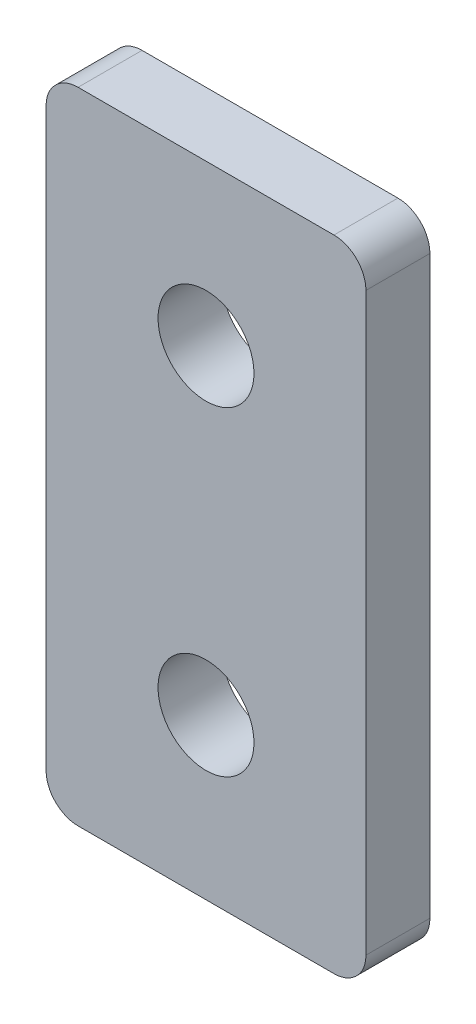
ISO-10303-21;
HEADER;
FILE_DESCRIPTION(('STEP AP214'),'2;1');
FILE_NAME('part.step','',(''),(''),'','','');
FILE_SCHEMA(('AUTOMOTIVE_DESIGN { 1 0 10303 214 1 1 1 1 }'));
ENDSEC;
DATA;
#1=APPLICATION_CONTEXT('core data for automotive mechanical design processes');
#2=APPLICATION_PROTOCOL_DEFINITION('international standard','automotive_design',2000,#1);
#3=PRODUCT_CONTEXT('',#1,'mechanical');
#4=PRODUCT('Part','Part','',(#3));
#5=PRODUCT_RELATED_PRODUCT_CATEGORY('part','',(#4));
#6=PRODUCT_DEFINITION_FORMATION('','',#4);
#7=PRODUCT_DEFINITION_CONTEXT('part definition',#1,'design');
#8=PRODUCT_DEFINITION('design','',#6,#7);
#9=PRODUCT_DEFINITION_SHAPE('','',#8);
#10=(LENGTH_UNIT() NAMED_UNIT(*) SI_UNIT(.MILLI.,.METRE.));
#11=(NAMED_UNIT(*) PLANE_ANGLE_UNIT() SI_UNIT($,.RADIAN.));
#12=(NAMED_UNIT(*) SI_UNIT($,.STERADIAN.) SOLID_ANGLE_UNIT());
#13=UNCERTAINTY_MEASURE_WITH_UNIT(LENGTH_MEASURE(1.E-05),#10,'distance_accuracy_value','');
#14=(GEOMETRIC_REPRESENTATION_CONTEXT(3) GLOBAL_UNCERTAINTY_ASSIGNED_CONTEXT((#13)) GLOBAL_UNIT_ASSIGNED_CONTEXT((#10,
#11,#12)) REPRESENTATION_CONTEXT('',''));
#15=CARTESIAN_POINT('',(0.,0.,0.));
#16=DIRECTION('',(0.,0.,1.));
#17=DIRECTION('',(1.,0.,0.));
#18=AXIS2_PLACEMENT_3D('',#15,#16,#17);
#19=CARTESIAN_POINT('',(0.,0.,2.));
#20=DIRECTION('',(0.,0.,1.));
#21=DIRECTION('',(1.,0.,0.));
#22=AXIS2_PLACEMENT_3D('',#19,#20,#21);
#23=PLANE('',#22);
#24=CARTESIAN_POINT('',(1.64208363104601,-6.90903272023804,2.));
#25=DIRECTION('',(0.,0.,1.));
#26=DIRECTION('',(1.,0.,0.));
#27=AXIS2_PLACEMENT_3D('',#24,#25,#26);
#28=CIRCLE('',#27,1.5);
#29=CARTESIAN_POINT('',(3.14208363104601,-6.90903272023804,2.));
#30=VERTEX_POINT('',#29);
#31=EDGE_CURVE('E136',#30,#30,#28,.T.);
#32=ORIENTED_EDGE('',*,*,#31,.F.);
#33=EDGE_LOOP('',(#32));
#34=FACE_BOUND('',#33,.T.);
#35=DIRECTION('',(0.,-1.,0.));
#36=VECTOR('',#35,1.);
#37=CARTESIAN_POINT('',(-3.35791636895399,-1.90903272023804,2.));
#38=LINE('',#37,#36);
#39=CARTESIAN_POINT('',(-3.35791636895399,-2.90903272023804,2.));
#40=VERTEX_POINT('',#39);
#41=CARTESIAN_POINT('',(-3.35791636895399,-20.909032720238,2.));
#42=VERTEX_POINT('',#41);
#43=EDGE_CURVE('E141',#40,#42,#38,.T.);
#44=ORIENTED_EDGE('',*,*,#43,.T.);
#45=CARTESIAN_POINT('',(-2.35791636895399,-20.909032720238,2.));
#46=DIRECTION('',(0.,0.,1.));
#47=DIRECTION('',(1.,0.,0.));
#48=AXIS2_PLACEMENT_3D('',#45,#46,#47);
#49=CIRCLE('',#48,1.);
#50=CARTESIAN_POINT('',(-2.35791636895399,-21.909032720238,2.));
#51=VERTEX_POINT('',#50);
#52=EDGE_CURVE('E156',#42,#51,#49,.T.);
#53=ORIENTED_EDGE('',*,*,#52,.T.);
#54=DIRECTION('',(1.,0.,0.));
#55=VECTOR('',#54,1.);
#56=CARTESIAN_POINT('',(-3.35791636895399,-21.909032720238,2.));
#57=LINE('',#56,#55);
#58=CARTESIAN_POINT('',(5.64208363104601,-21.909032720238,2.));
#59=VERTEX_POINT('',#58);
#60=EDGE_CURVE('E123',#51,#59,#57,.T.);
#61=ORIENTED_EDGE('',*,*,#60,.T.);
#62=CARTESIAN_POINT('',(5.64208363104601,-20.909032720238,2.));
#63=DIRECTION('',(0.,0.,1.));
#64=DIRECTION('',(1.,0.,0.));
#65=AXIS2_PLACEMENT_3D('',#62,#63,#64);
#66=CIRCLE('',#65,1.);
#67=CARTESIAN_POINT('',(6.64208363104601,-20.909032720238,2.));
#68=VERTEX_POINT('',#67);
#69=EDGE_CURVE('E154',#59,#68,#66,.T.);
#70=ORIENTED_EDGE('',*,*,#69,.T.);
#71=DIRECTION('',(0.,1.,0.));
#72=VECTOR('',#71,1.);
#73=CARTESIAN_POINT('',(6.64208363104601,-1.90903272023804,2.));
#74=LINE('',#73,#72);
#75=CARTESIAN_POINT('',(6.64208363104601,-2.90903272023804,2.));
#76=VERTEX_POINT('',#75);
#77=EDGE_CURVE('E176',#68,#76,#74,.T.);
#78=ORIENTED_EDGE('',*,*,#77,.T.);
#79=CARTESIAN_POINT('',(5.64208363104601,-2.90903272023804,2.));
#80=DIRECTION('',(0.,0.,1.));
#81=DIRECTION('',(1.,0.,0.));
#82=AXIS2_PLACEMENT_3D('',#79,#80,#81);
#83=CIRCLE('',#82,1.);
#84=CARTESIAN_POINT('',(5.64208363104601,-1.90903272023804,2.));
#85=VERTEX_POINT('',#84);
#86=EDGE_CURVE('E58',#76,#85,#83,.T.);
#87=ORIENTED_EDGE('',*,*,#86,.T.);
#88=DIRECTION('',(-1.,0.,0.));
#89=VECTOR('',#88,1.);
#90=CARTESIAN_POINT('',(-3.35791636895399,-1.90903272023804,2.));
#91=LINE('',#90,#89);
#92=CARTESIAN_POINT('',(-2.35791636895399,-1.90903272023804,2.));
#93=VERTEX_POINT('',#92);
#94=EDGE_CURVE('E142',#85,#93,#91,.T.);
#95=ORIENTED_EDGE('',*,*,#94,.T.);
#96=CARTESIAN_POINT('',(-2.35791636895399,-2.90903272023804,2.));
#97=DIRECTION('',(0.,0.,1.));
#98=DIRECTION('',(1.,0.,0.));
#99=AXIS2_PLACEMENT_3D('',#96,#97,#98);
#100=CIRCLE('',#99,1.);
#101=EDGE_CURVE('E152',#93,#40,#100,.T.);
#102=ORIENTED_EDGE('',*,*,#101,.T.);
#103=EDGE_LOOP('',(#44,#53,#61,#70,#78,#87,#95,#102));
#104=FACE_BOUND('',#103,.T.);
#105=CARTESIAN_POINT('',(1.64208363104601,-16.909032720238,2.));
#106=DIRECTION('',(0.,0.,1.));
#107=DIRECTION('',(1.,0.,0.));
#108=AXIS2_PLACEMENT_3D('',#105,#106,#107);
#109=CIRCLE('',#108,1.5);
#110=CARTESIAN_POINT('',(3.14208363104601,-16.909032720238,2.));
#111=VERTEX_POINT('',#110);
#112=EDGE_CURVE('E188',#111,#111,#109,.T.);
#113=ORIENTED_EDGE('',*,*,#112,.F.);
#114=EDGE_LOOP('',(#113));
#115=FACE_BOUND('',#114,.T.);
#116=ADVANCED_FACE('F38',(#34,#104,#115),#23,.T.);
#117=CARTESIAN_POINT('',(0.,0.,0.));
#118=DIRECTION('',(0.,0.,1.));
#119=DIRECTION('',(1.,0.,0.));
#120=AXIS2_PLACEMENT_3D('',#117,#118,#119);
#121=PLANE('',#120);
#122=DIRECTION('',(1.,0.,0.));
#123=VECTOR('',#122,1.);
#124=CARTESIAN_POINT('',(-3.35791636895399,-21.909032720238,0.));
#125=LINE('',#124,#123);
#126=CARTESIAN_POINT('',(-2.35791636895399,-21.909032720238,0.));
#127=VERTEX_POINT('',#126);
#128=CARTESIAN_POINT('',(5.64208363104601,-21.909032720238,0.));
#129=VERTEX_POINT('',#128);
#130=EDGE_CURVE('E120',#127,#129,#125,.T.);
#131=ORIENTED_EDGE('',*,*,#130,.F.);
#132=CARTESIAN_POINT('',(-2.35791636895399,-20.909032720238,0.));
#133=DIRECTION('',(0.,0.,1.));
#134=DIRECTION('',(1.,0.,0.));
#135=AXIS2_PLACEMENT_3D('',#132,#133,#134);
#136=CIRCLE('',#135,1.);
#137=CARTESIAN_POINT('',(-3.35791636895399,-20.909032720238,0.));
#138=VERTEX_POINT('',#137);
#139=EDGE_CURVE('E103',#127,#138,#136,.F.);
#140=ORIENTED_EDGE('',*,*,#139,.T.);
#141=DIRECTION('',(0.,-1.,0.));
#142=VECTOR('',#141,1.);
#143=CARTESIAN_POINT('',(-3.35791636895399,-1.90903272023804,0.));
#144=LINE('',#143,#142);
#145=CARTESIAN_POINT('',(-3.35791636895399,-2.90903272023804,0.));
#146=VERTEX_POINT('',#145);
#147=EDGE_CURVE('E131',#146,#138,#144,.T.);
#148=ORIENTED_EDGE('',*,*,#147,.F.);
#149=CARTESIAN_POINT('',(-2.35791636895399,-2.90903272023804,0.));
#150=DIRECTION('',(0.,0.,1.));
#151=DIRECTION('',(1.,0.,0.));
#152=AXIS2_PLACEMENT_3D('',#149,#150,#151);
#153=CIRCLE('',#152,1.);
#154=CARTESIAN_POINT('',(-2.35791636895399,-1.90903272023804,0.));
#155=VERTEX_POINT('',#154);
#156=EDGE_CURVE('E145',#146,#155,#153,.F.);
#157=ORIENTED_EDGE('',*,*,#156,.T.);
#158=DIRECTION('',(-1.,0.,0.));
#159=VECTOR('',#158,1.);
#160=CARTESIAN_POINT('',(-3.35791636895399,-1.90903272023804,0.));
#161=LINE('',#160,#159);
#162=CARTESIAN_POINT('',(5.64208363104601,-1.90903272023804,0.));
#163=VERTEX_POINT('',#162);
#164=EDGE_CURVE('E134',#163,#155,#161,.T.);
#165=ORIENTED_EDGE('',*,*,#164,.F.);
#166=CARTESIAN_POINT('',(5.64208363104601,-2.90903272023804,0.));
#167=DIRECTION('',(0.,0.,1.));
#168=DIRECTION('',(1.,0.,0.));
#169=AXIS2_PLACEMENT_3D('',#166,#167,#168);
#170=CIRCLE('',#169,1.);
#171=CARTESIAN_POINT('',(6.64208363104601,-2.90903272023804,0.));
#172=VERTEX_POINT('',#171);
#173=EDGE_CURVE('E124',#163,#172,#170,.F.);
#174=ORIENTED_EDGE('',*,*,#173,.T.);
#175=DIRECTION('',(0.,1.,0.));
#176=VECTOR('',#175,1.);
#177=CARTESIAN_POINT('',(6.64208363104601,-1.90903272023804,0.));
#178=LINE('',#177,#176);
#179=CARTESIAN_POINT('',(6.64208363104601,-20.909032720238,0.));
#180=VERTEX_POINT('',#179);
#181=EDGE_CURVE('E130',#180,#172,#178,.T.);
#182=ORIENTED_EDGE('',*,*,#181,.F.);
#183=CARTESIAN_POINT('',(5.64208363104601,-20.909032720238,0.));
#184=DIRECTION('',(0.,0.,1.));
#185=DIRECTION('',(1.,0.,0.));
#186=AXIS2_PLACEMENT_3D('',#183,#184,#185);
#187=CIRCLE('',#186,1.);
#188=EDGE_CURVE('E114',#180,#129,#187,.F.);
#189=ORIENTED_EDGE('',*,*,#188,.T.);
#190=EDGE_LOOP('',(#131,#140,#148,#157,#165,#174,#182,#189));
#191=FACE_BOUND('',#190,.T.);
#192=CARTESIAN_POINT('',(1.64208363104601,-6.90903272023804,0.));
#193=DIRECTION('',(0.,0.,1.));
#194=DIRECTION('',(1.,0.,0.));
#195=AXIS2_PLACEMENT_3D('',#192,#193,#194);
#196=CIRCLE('',#195,1.5);
#197=CARTESIAN_POINT('',(3.14208363104601,-6.90903272023804,0.));
#198=VERTEX_POINT('',#197);
#199=EDGE_CURVE('E179',#198,#198,#196,.T.);
#200=ORIENTED_EDGE('',*,*,#199,.T.);
#201=EDGE_LOOP('',(#200));
#202=FACE_BOUND('',#201,.T.);
#203=CARTESIAN_POINT('',(1.64208363104601,-16.909032720238,0.));
#204=DIRECTION('',(0.,0.,1.));
#205=DIRECTION('',(1.,0.,0.));
#206=AXIS2_PLACEMENT_3D('',#203,#204,#205);
#207=CIRCLE('',#206,1.5);
#208=CARTESIAN_POINT('',(3.14208363104601,-16.909032720238,0.));
#209=VERTEX_POINT('',#208);
#210=EDGE_CURVE('E190',#209,#209,#207,.T.);
#211=ORIENTED_EDGE('',*,*,#210,.T.);
#212=EDGE_LOOP('',(#211));
#213=FACE_BOUND('',#212,.T.);
#214=ADVANCED_FACE('F127',(#191,#202,#213),#121,.F.);
#215=CARTESIAN_POINT('',(-3.35791636895399,-1.90903272023804,2.));
#216=DIRECTION('',(1.,0.,0.));
#217=DIRECTION('',(0.,1.,0.));
#218=AXIS2_PLACEMENT_3D('',#215,#216,#217);
#219=PLANE('',#218);
#220=ORIENTED_EDGE('',*,*,#147,.T.);
#221=DIRECTION('',(0.,0.,-1.));
#222=VECTOR('',#221,1.);
#223=CARTESIAN_POINT('',(-3.35791636895399,-20.909032720238,2.));
#224=LINE('',#223,#222);
#225=EDGE_CURVE('E108',#138,#42,#224,.F.);
#226=ORIENTED_EDGE('',*,*,#225,.T.);
#227=ORIENTED_EDGE('',*,*,#43,.F.);
#228=DIRECTION('',(0.,0.,-1.));
#229=VECTOR('',#228,1.);
#230=CARTESIAN_POINT('',(-3.35791636895399,-2.90903272023804,2.));
#231=LINE('',#230,#229);
#232=EDGE_CURVE('E113',#40,#146,#231,.T.);
#233=ORIENTED_EDGE('',*,*,#232,.T.);
#234=EDGE_LOOP('',(#220,#226,#227,#233));
#235=FACE_BOUND('',#234,.T.);
#236=ADVANCED_FACE('F173',(#235),#219,.F.);
#237=CARTESIAN_POINT('',(-3.35791636895399,-21.909032720238,2.));
#238=DIRECTION('',(0.,1.,0.));
#239=DIRECTION('',(0.,0.,1.));
#240=AXIS2_PLACEMENT_3D('',#237,#238,#239);
#241=PLANE('',#240);
#242=ORIENTED_EDGE('',*,*,#60,.F.);
#243=DIRECTION('',(0.,0.,-1.));
#244=VECTOR('',#243,1.);
#245=CARTESIAN_POINT('',(-2.35791636895399,-21.909032720238,2.));
#246=LINE('',#245,#244);
#247=EDGE_CURVE('E107',#51,#127,#246,.T.);
#248=ORIENTED_EDGE('',*,*,#247,.T.);
#249=ORIENTED_EDGE('',*,*,#130,.T.);
#250=DIRECTION('',(0.,0.,-1.));
#251=VECTOR('',#250,1.);
#252=CARTESIAN_POINT('',(5.64208363104601,-21.909032720238,2.));
#253=LINE('',#252,#251);
#254=EDGE_CURVE('E125',#129,#59,#253,.F.);
#255=ORIENTED_EDGE('',*,*,#254,.T.);
#256=EDGE_LOOP('',(#242,#248,#249,#255));
#257=FACE_BOUND('',#256,.T.);
#258=ADVANCED_FACE('F119',(#257),#241,.F.);
#259=CARTESIAN_POINT('',(6.64208363104601,-1.90903272023804,2.));
#260=DIRECTION('',(-1.,0.,0.));
#261=DIRECTION('',(0.,-1.,0.));
#262=AXIS2_PLACEMENT_3D('',#259,#260,#261);
#263=PLANE('',#262);
#264=ORIENTED_EDGE('',*,*,#77,.F.);
#265=DIRECTION('',(0.,0.,-1.));
#266=VECTOR('',#265,1.);
#267=CARTESIAN_POINT('',(6.64208363104601,-20.909032720238,2.));
#268=LINE('',#267,#266);
#269=EDGE_CURVE('E160',#68,#180,#268,.T.);
#270=ORIENTED_EDGE('',*,*,#269,.T.);
#271=ORIENTED_EDGE('',*,*,#181,.T.);
#272=DIRECTION('',(0.,0.,-1.));
#273=VECTOR('',#272,1.);
#274=CARTESIAN_POINT('',(6.64208363104601,-2.90903272023804,2.));
#275=LINE('',#274,#273);
#276=EDGE_CURVE('E158',#172,#76,#275,.F.);
#277=ORIENTED_EDGE('',*,*,#276,.T.);
#278=EDGE_LOOP('',(#264,#270,#271,#277));
#279=FACE_BOUND('',#278,.T.);
#280=ADVANCED_FACE('F219',(#279),#263,.F.);
#281=CARTESIAN_POINT('',(-3.35791636895399,-1.90903272023804,2.));
#282=DIRECTION('',(0.,-1.,0.));
#283=DIRECTION('',(0.,0.,-1.));
#284=AXIS2_PLACEMENT_3D('',#281,#282,#283);
#285=PLANE('',#284);
#286=ORIENTED_EDGE('',*,*,#164,.T.);
#287=DIRECTION('',(0.,0.,-1.));
#288=VECTOR('',#287,1.);
#289=CARTESIAN_POINT('',(-2.35791636895399,-1.90903272023804,2.));
#290=LINE('',#289,#288);
#291=EDGE_CURVE('E11',#155,#93,#290,.F.);
#292=ORIENTED_EDGE('',*,*,#291,.T.);
#293=ORIENTED_EDGE('',*,*,#94,.F.);
#294=DIRECTION('',(0.,0.,-1.));
#295=VECTOR('',#294,1.);
#296=CARTESIAN_POINT('',(5.64208363104601,-1.90903272023804,2.));
#297=LINE('',#296,#295);
#298=EDGE_CURVE('E46',#85,#163,#297,.T.);
#299=ORIENTED_EDGE('',*,*,#298,.T.);
#300=EDGE_LOOP('',(#286,#292,#293,#299));
#301=FACE_BOUND('',#300,.T.);
#302=ADVANCED_FACE('F165',(#301),#285,.F.);
#303=CARTESIAN_POINT('',(1.64208363104601,-6.90903272023804,2.));
#304=DIRECTION('',(0.,0.,-1.));
#305=DIRECTION('',(-1.,0.,0.));
#306=AXIS2_PLACEMENT_3D('',#303,#304,#305);
#307=CYLINDRICAL_SURFACE('',#306,1.5);
#308=ORIENTED_EDGE('',*,*,#31,.T.);
#309=EDGE_LOOP('',(#308));
#310=FACE_BOUND('',#309,.T.);
#311=ORIENTED_EDGE('',*,*,#199,.F.);
#312=EDGE_LOOP('',(#311));
#313=FACE_BOUND('',#312,.T.);
#314=ADVANCED_FACE('F198',(#310,#313),#307,.F.);
#315=CARTESIAN_POINT('',(1.64208363104601,-16.909032720238,2.));
#316=DIRECTION('',(0.,0.,-1.));
#317=DIRECTION('',(-1.,0.,0.));
#318=AXIS2_PLACEMENT_3D('',#315,#316,#317);
#319=CYLINDRICAL_SURFACE('',#318,1.5);
#320=ORIENTED_EDGE('',*,*,#112,.T.);
#321=EDGE_LOOP('',(#320));
#322=FACE_BOUND('',#321,.T.);
#323=ORIENTED_EDGE('',*,*,#210,.F.);
#324=EDGE_LOOP('',(#323));
#325=FACE_BOUND('',#324,.T.);
#326=ADVANCED_FACE('F201',(#322,#325),#319,.F.);
#327=CARTESIAN_POINT('',(-2.35791636895399,-20.909032720238,2.));
#328=DIRECTION('',(0.,0.,-1.));
#329=DIRECTION('',(-1.,0.,0.));
#330=AXIS2_PLACEMENT_3D('',#327,#328,#329);
#331=CYLINDRICAL_SURFACE('',#330,1.);
#332=ORIENTED_EDGE('',*,*,#52,.F.);
#333=ORIENTED_EDGE('',*,*,#225,.F.);
#334=ORIENTED_EDGE('',*,*,#139,.F.);
#335=ORIENTED_EDGE('',*,*,#247,.F.);
#336=EDGE_LOOP('',(#332,#333,#334,#335));
#337=FACE_BOUND('',#336,.T.);
#338=ADVANCED_FACE('F106',(#337),#331,.T.);
#339=CARTESIAN_POINT('',(5.64208363104601,-20.909032720238,2.));
#340=DIRECTION('',(0.,0.,-1.));
#341=DIRECTION('',(-1.,0.,0.));
#342=AXIS2_PLACEMENT_3D('',#339,#340,#341);
#343=CYLINDRICAL_SURFACE('',#342,1.);
#344=ORIENTED_EDGE('',*,*,#69,.F.);
#345=ORIENTED_EDGE('',*,*,#254,.F.);
#346=ORIENTED_EDGE('',*,*,#188,.F.);
#347=ORIENTED_EDGE('',*,*,#269,.F.);
#348=EDGE_LOOP('',(#344,#345,#346,#347));
#349=FACE_BOUND('',#348,.T.);
#350=ADVANCED_FACE('F214',(#349),#343,.T.);
#351=CARTESIAN_POINT('',(-2.35791636895399,-2.90903272023804,2.));
#352=DIRECTION('',(0.,0.,-1.));
#353=DIRECTION('',(-1.,0.,0.));
#354=AXIS2_PLACEMENT_3D('',#351,#352,#353);
#355=CYLINDRICAL_SURFACE('',#354,1.);
#356=ORIENTED_EDGE('',*,*,#101,.F.);
#357=ORIENTED_EDGE('',*,*,#291,.F.);
#358=ORIENTED_EDGE('',*,*,#156,.F.);
#359=ORIENTED_EDGE('',*,*,#232,.F.);
#360=EDGE_LOOP('',(#356,#357,#358,#359));
#361=FACE_BOUND('',#360,.T.);
#362=ADVANCED_FACE('F170',(#361),#355,.T.);
#363=CARTESIAN_POINT('',(5.64208363104601,-2.90903272023804,2.));
#364=DIRECTION('',(0.,0.,-1.));
#365=DIRECTION('',(-1.,0.,0.));
#366=AXIS2_PLACEMENT_3D('',#363,#364,#365);
#367=CYLINDRICAL_SURFACE('',#366,1.);
#368=ORIENTED_EDGE('',*,*,#86,.F.);
#369=ORIENTED_EDGE('',*,*,#276,.F.);
#370=ORIENTED_EDGE('',*,*,#173,.F.);
#371=ORIENTED_EDGE('',*,*,#298,.F.);
#372=EDGE_LOOP('',(#368,#369,#370,#371));
#373=FACE_BOUND('',#372,.T.);
#374=ADVANCED_FACE('F40',(#373),#367,.T.);
#375=CLOSED_SHELL('',(#116,#214,#236,#258,#280,#302,#314,#326,#338,#350,#362,#374));
#376=MANIFOLD_SOLID_BREP('B2',#375);
#377=ADVANCED_BREP_SHAPE_REPRESENTATION('',(#18,#376),#14);
#378=SHAPE_DEFINITION_REPRESENTATION(#9,#377);
ENDSEC;
END-ISO-10303-21;
